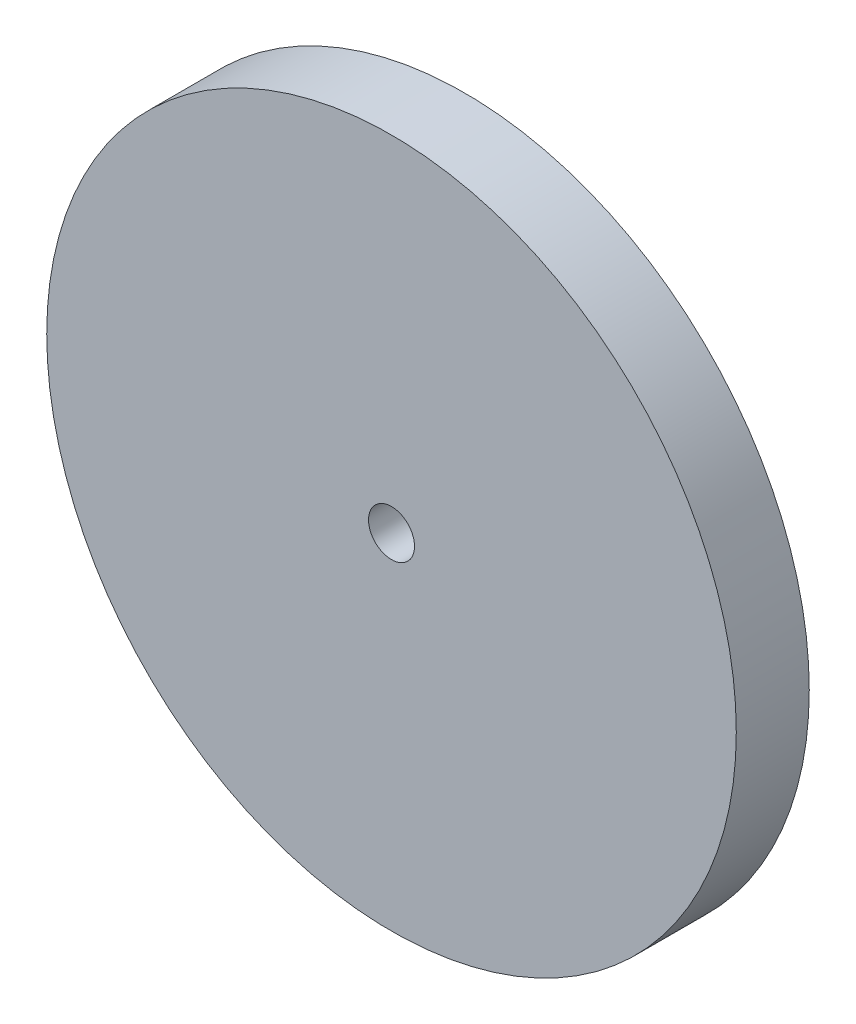
ISO-10303-21;
HEADER;
FILE_DESCRIPTION(('STEP AP214'),'2;1');
FILE_NAME('part.step','',(''),(''),'','','');
FILE_SCHEMA(('AUTOMOTIVE_DESIGN { 1 0 10303 214 1 1 1 1 }'));
ENDSEC;
DATA;
#1=APPLICATION_CONTEXT('core data for automotive mechanical design processes');
#2=APPLICATION_PROTOCOL_DEFINITION('international standard','automotive_design',2000,#1);
#3=PRODUCT_CONTEXT('',#1,'mechanical');
#4=PRODUCT('Part','Part','',(#3));
#5=PRODUCT_RELATED_PRODUCT_CATEGORY('part','',(#4));
#6=PRODUCT_DEFINITION_FORMATION('','',#4);
#7=PRODUCT_DEFINITION_CONTEXT('part definition',#1,'design');
#8=PRODUCT_DEFINITION('design','',#6,#7);
#9=PRODUCT_DEFINITION_SHAPE('','',#8);
#10=(LENGTH_UNIT() NAMED_UNIT(*) SI_UNIT(.MILLI.,.METRE.));
#11=(NAMED_UNIT(*) PLANE_ANGLE_UNIT() SI_UNIT($,.RADIAN.));
#12=(NAMED_UNIT(*) SI_UNIT($,.STERADIAN.) SOLID_ANGLE_UNIT());
#13=UNCERTAINTY_MEASURE_WITH_UNIT(LENGTH_MEASURE(1.E-05),#10,'distance_accuracy_value','');
#14=(GEOMETRIC_REPRESENTATION_CONTEXT(3) GLOBAL_UNCERTAINTY_ASSIGNED_CONTEXT((#13)) GLOBAL_UNIT_ASSIGNED_CONTEXT((#10,
#11,#12)) REPRESENTATION_CONTEXT('',''));
#15=CARTESIAN_POINT('',(0.,0.,0.));
#16=DIRECTION('',(0.,0.,1.));
#17=DIRECTION('',(1.,0.,0.));
#18=AXIS2_PLACEMENT_3D('',#15,#16,#17);
#19=CARTESIAN_POINT('',(0.,0.,3.175));
#20=DIRECTION('',(0.,0.,-1.));
#21=DIRECTION('',(-1.,0.,0.));
#22=AXIS2_PLACEMENT_3D('',#19,#20,#21);
#23=CYLINDRICAL_SURFACE('',#22,15.);
#24=CARTESIAN_POINT('',(0.,0.,3.175));
#25=DIRECTION('',(0.,0.,1.));
#26=DIRECTION('',(1.,0.,0.));
#27=AXIS2_PLACEMENT_3D('',#24,#25,#26);
#28=CIRCLE('',#27,15.);
#29=CARTESIAN_POINT('',(15.,0.,3.175));
#30=VERTEX_POINT('',#29);
#31=EDGE_CURVE('E10',#30,#30,#28,.T.);
#32=ORIENTED_EDGE('',*,*,#31,.F.);
#33=EDGE_LOOP('',(#32));
#34=FACE_BOUND('',#33,.T.);
#35=CARTESIAN_POINT('',(0.,0.,0.));
#36=DIRECTION('',(0.,0.,1.));
#37=DIRECTION('',(1.,0.,0.));
#38=AXIS2_PLACEMENT_3D('',#35,#36,#37);
#39=CIRCLE('',#38,15.);
#40=CARTESIAN_POINT('',(15.,0.,0.));
#41=VERTEX_POINT('',#40);
#42=EDGE_CURVE('E42',#41,#41,#39,.T.);
#43=ORIENTED_EDGE('',*,*,#42,.T.);
#44=EDGE_LOOP('',(#43));
#45=FACE_BOUND('',#44,.T.);
#46=ADVANCED_FACE('F39',(#34,#45),#23,.T.);
#47=CARTESIAN_POINT('',(0.,0.,3.175));
#48=DIRECTION('',(0.,0.,1.));
#49=DIRECTION('',(1.,0.,0.));
#50=AXIS2_PLACEMENT_3D('',#47,#48,#49);
#51=PLANE('',#50);
#52=CARTESIAN_POINT('',(0.,0.,3.175));
#53=DIRECTION('',(0.,0.,1.));
#54=DIRECTION('',(1.,0.,0.));
#55=AXIS2_PLACEMENT_3D('',#52,#53,#54);
#56=CIRCLE('',#55,1.);
#57=CARTESIAN_POINT('',(1.,0.,3.175));
#58=VERTEX_POINT('',#57);
#59=EDGE_CURVE('E53',#58,#58,#56,.T.);
#60=ORIENTED_EDGE('',*,*,#59,.F.);
#61=EDGE_LOOP('',(#60));
#62=FACE_BOUND('',#61,.T.);
#63=ORIENTED_EDGE('',*,*,#31,.T.);
#64=EDGE_LOOP('',(#63));
#65=FACE_BOUND('',#64,.T.);
#66=ADVANCED_FACE('F70',(#62,#65),#51,.T.);
#67=CARTESIAN_POINT('',(0.,0.,0.));
#68=DIRECTION('',(0.,0.,1.));
#69=DIRECTION('',(1.,0.,0.));
#70=AXIS2_PLACEMENT_3D('',#67,#68,#69);
#71=PLANE('',#70);
#72=CARTESIAN_POINT('',(0.,0.,0.));
#73=DIRECTION('',(0.,0.,1.));
#74=DIRECTION('',(1.,0.,0.));
#75=AXIS2_PLACEMENT_3D('',#72,#73,#74);
#76=CIRCLE('',#75,1.);
#77=CARTESIAN_POINT('',(1.,0.,0.));
#78=VERTEX_POINT('',#77);
#79=EDGE_CURVE('E51',#78,#78,#76,.T.);
#80=ORIENTED_EDGE('',*,*,#79,.T.);
#81=EDGE_LOOP('',(#80));
#82=FACE_BOUND('',#81,.T.);
#83=ORIENTED_EDGE('',*,*,#42,.F.);
#84=EDGE_LOOP('',(#83));
#85=FACE_BOUND('',#84,.T.);
#86=ADVANCED_FACE('F61',(#82,#85),#71,.F.);
#87=CARTESIAN_POINT('',(0.,0.,0.));
#88=DIRECTION('',(0.,0.,1.));
#89=DIRECTION('',(1.,0.,0.));
#90=AXIS2_PLACEMENT_3D('',#87,#88,#89);
#91=CYLINDRICAL_SURFACE('',#90,1.);
#92=ORIENTED_EDGE('',*,*,#79,.F.);
#93=EDGE_LOOP('',(#92));
#94=FACE_BOUND('',#93,.T.);
#95=ORIENTED_EDGE('',*,*,#59,.T.);
#96=EDGE_LOOP('',(#95));
#97=FACE_BOUND('',#96,.T.);
#98=ADVANCED_FACE('F64',(#94,#97),#91,.F.);
#99=CLOSED_SHELL('',(#46,#66,#86,#98));
#100=MANIFOLD_SOLID_BREP('B2',#99);
#101=ADVANCED_BREP_SHAPE_REPRESENTATION('',(#18,#100),#14);
#102=SHAPE_DEFINITION_REPRESENTATION(#9,#101);
ENDSEC;
END-ISO-10303-21;
